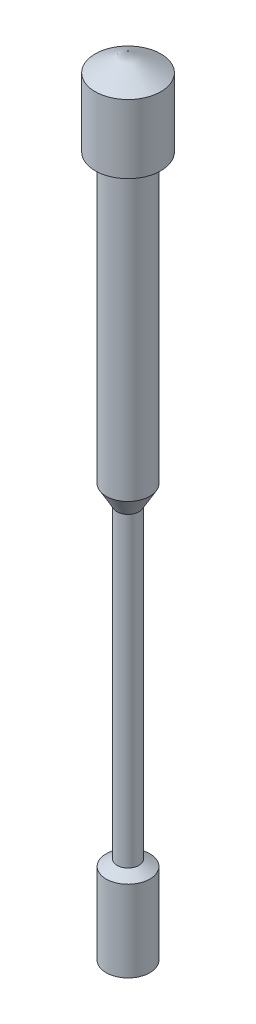
ISO-10303-21;
HEADER;
FILE_DESCRIPTION(('STEP AP214'),'2;1');
FILE_NAME('part.step','',(''),(''),'','','');
FILE_SCHEMA(('AUTOMOTIVE_DESIGN { 1 0 10303 214 1 1 1 1 }'));
ENDSEC;
DATA;
#1=APPLICATION_CONTEXT('core data for automotive mechanical design processes');
#2=APPLICATION_PROTOCOL_DEFINITION('international standard','automotive_design',2000,#1);
#3=PRODUCT_CONTEXT('',#1,'mechanical');
#4=PRODUCT('Part','Part','',(#3));
#5=PRODUCT_RELATED_PRODUCT_CATEGORY('part','',(#4));
#6=PRODUCT_DEFINITION_FORMATION('','',#4);
#7=PRODUCT_DEFINITION_CONTEXT('part definition',#1,'design');
#8=PRODUCT_DEFINITION('design','',#6,#7);
#9=PRODUCT_DEFINITION_SHAPE('','',#8);
#10=(LENGTH_UNIT() NAMED_UNIT(*) SI_UNIT(.MILLI.,.METRE.));
#11=(NAMED_UNIT(*) PLANE_ANGLE_UNIT() SI_UNIT($,.RADIAN.));
#12=(NAMED_UNIT(*) SI_UNIT($,.STERADIAN.) SOLID_ANGLE_UNIT());
#13=UNCERTAINTY_MEASURE_WITH_UNIT(LENGTH_MEASURE(1.E-05),#10,'distance_accuracy_value','');
#14=(GEOMETRIC_REPRESENTATION_CONTEXT(3) GLOBAL_UNCERTAINTY_ASSIGNED_CONTEXT((#13)) GLOBAL_UNIT_ASSIGNED_CONTEXT((#10,
#11,#12)) REPRESENTATION_CONTEXT('',''));
#15=CARTESIAN_POINT('',(0.,0.,0.));
#16=DIRECTION('',(0.,0.,1.));
#17=DIRECTION('',(1.,0.,0.));
#18=AXIS2_PLACEMENT_3D('',#15,#16,#17);
#19=CARTESIAN_POINT('',(0.,17.5669872981078,0.));
#20=DIRECTION('',(0.,-1.,0.));
#21=DIRECTION('',(0.,0.,-1.));
#22=AXIS2_PLACEMENT_3D('',#19,#20,#21);
#23=CONICAL_SURFACE('',#22,0.750000000000001,1.0471975511966);
#24=CARTESIAN_POINT('',(0.,18.,0.));
#25=VERTEX_POINT('',#24);
#26=VERTEX_LOOP('',#25);
#27=FACE_BOUND('',#26,.T.);
#28=CARTESIAN_POINT('',(0.,17.5669872981078,0.));
#29=DIRECTION('',(0.,-1.,0.));
#30=DIRECTION('',(0.,0.,-1.));
#31=AXIS2_PLACEMENT_3D('',#28,#29,#30);
#32=CIRCLE('',#31,0.750000000000001);
#33=CARTESIAN_POINT('',(0.,17.5669872981078,-0.750000000000001));
#34=VERTEX_POINT('',#33);
#35=EDGE_CURVE('E11',#34,#34,#32,.T.);
#36=ORIENTED_EDGE('',*,*,#35,.F.);
#37=EDGE_LOOP('',(#36));
#38=FACE_BOUND('',#37,.T.);
#39=ADVANCED_FACE('F33',(#27,#38),#23,.T.);
#40=CARTESIAN_POINT('',(0.,0.,0.));
#41=DIRECTION('',(0.,-1.,0.));
#42=DIRECTION('',(0.,0.,-1.));
#43=AXIS2_PLACEMENT_3D('',#40,#41,#42);
#44=CYLINDRICAL_SURFACE('',#43,0.750000000000001);
#45=ORIENTED_EDGE('',*,*,#35,.T.);
#46=EDGE_LOOP('',(#45));
#47=FACE_BOUND('',#46,.T.);
#48=CARTESIAN_POINT('',(0.,16.,0.));
#49=DIRECTION('',(0.,-1.,0.));
#50=DIRECTION('',(0.,0.,-1.));
#51=AXIS2_PLACEMENT_3D('',#48,#49,#50);
#52=CIRCLE('',#51,0.750000000000001);
#53=CARTESIAN_POINT('',(0.,16.,-0.750000000000001));
#54=VERTEX_POINT('',#53);
#55=EDGE_CURVE('E39',#54,#54,#52,.T.);
#56=ORIENTED_EDGE('',*,*,#55,.F.);
#57=EDGE_LOOP('',(#56));
#58=FACE_BOUND('',#57,.T.);
#59=ADVANCED_FACE('F44',(#47,#58),#44,.T.);
#60=CARTESIAN_POINT('',(0.750000000000001,16.,0.));
#61=DIRECTION('',(0.,-1.,0.));
#62=DIRECTION('',(0.,0.,-1.));
#63=AXIS2_PLACEMENT_3D('',#60,#61,#62);
#64=PLANE('',#63);
#65=ORIENTED_EDGE('',*,*,#55,.T.);
#66=EDGE_LOOP('',(#65));
#67=FACE_BOUND('',#66,.T.);
#68=CARTESIAN_POINT('',(0.,16.,0.));
#69=DIRECTION('',(0.,-1.,0.));
#70=DIRECTION('',(0.,0.,-1.));
#71=AXIS2_PLACEMENT_3D('',#68,#69,#70);
#72=CIRCLE('',#71,0.5);
#73=CARTESIAN_POINT('',(0.,16.,-0.5));
#74=VERTEX_POINT('',#73);
#75=EDGE_CURVE('E53',#74,#74,#72,.T.);
#76=ORIENTED_EDGE('',*,*,#75,.F.);
#77=EDGE_LOOP('',(#76));
#78=FACE_BOUND('',#77,.T.);
#79=ADVANCED_FACE('F49',(#67,#78),#64,.T.);
#80=CARTESIAN_POINT('',(0.,0.,0.));
#81=DIRECTION('',(0.,-1.,0.));
#82=DIRECTION('',(0.,0.,-1.));
#83=AXIS2_PLACEMENT_3D('',#80,#81,#82);
#84=CYLINDRICAL_SURFACE('',#83,0.5);
#85=ORIENTED_EDGE('',*,*,#75,.T.);
#86=EDGE_LOOP('',(#85));
#87=FACE_BOUND('',#86,.T.);
#88=CARTESIAN_POINT('',(0.,9.43301270189223,0.));
#89=DIRECTION('',(0.,-1.,0.));
#90=DIRECTION('',(0.,0.,-1.));
#91=AXIS2_PLACEMENT_3D('',#88,#89,#90);
#92=CIRCLE('',#91,0.500000000000001);
#93=CARTESIAN_POINT('',(0.,9.43301270189223,-0.500000000000001));
#94=VERTEX_POINT('',#93);
#95=EDGE_CURVE('E55',#94,#94,#92,.T.);
#96=ORIENTED_EDGE('',*,*,#95,.F.);
#97=EDGE_LOOP('',(#96));
#98=FACE_BOUND('',#97,.T.);
#99=ADVANCED_FACE('F95',(#87,#98),#84,.T.);
#100=CARTESIAN_POINT('',(0.,9.,0.));
#101=DIRECTION('',(0.,1.,0.));
#102=DIRECTION('',(0.,0.,1.));
#103=AXIS2_PLACEMENT_3D('',#100,#101,#102);
#104=CONICAL_SURFACE('',#103,0.25,0.523598775598295);
#105=ORIENTED_EDGE('',*,*,#95,.T.);
#106=EDGE_LOOP('',(#105));
#107=FACE_BOUND('',#106,.T.);
#108=CARTESIAN_POINT('',(0.,9.,0.));
#109=DIRECTION('',(0.,-1.,0.));
#110=DIRECTION('',(0.,0.,-1.));
#111=AXIS2_PLACEMENT_3D('',#108,#109,#110);
#112=CIRCLE('',#111,0.25);
#113=CARTESIAN_POINT('',(0.,9.,-0.25));
#114=VERTEX_POINT('',#113);
#115=EDGE_CURVE('E60',#114,#114,#112,.T.);
#116=ORIENTED_EDGE('',*,*,#115,.F.);
#117=EDGE_LOOP('',(#116));
#118=FACE_BOUND('',#117,.T.);
#119=ADVANCED_FACE('F91',(#107,#118),#104,.T.);
#120=CARTESIAN_POINT('',(0.,0.,0.));
#121=DIRECTION('',(0.,-1.,0.));
#122=DIRECTION('',(0.,0.,-1.));
#123=AXIS2_PLACEMENT_3D('',#120,#121,#122);
#124=CYLINDRICAL_SURFACE('',#123,0.25);
#125=ORIENTED_EDGE('',*,*,#115,.T.);
#126=EDGE_LOOP('',(#125));
#127=FACE_BOUND('',#126,.T.);
#128=CARTESIAN_POINT('',(0.,2.,0.));
#129=DIRECTION('',(0.,-1.,0.));
#130=DIRECTION('',(0.,0.,-1.));
#131=AXIS2_PLACEMENT_3D('',#128,#129,#130);
#132=CIRCLE('',#131,0.250000000000001);
#133=CARTESIAN_POINT('',(0.,2.,-0.250000000000001));
#134=VERTEX_POINT('',#133);
#135=EDGE_CURVE('E63',#134,#134,#132,.T.);
#136=ORIENTED_EDGE('',*,*,#135,.F.);
#137=EDGE_LOOP('',(#136));
#138=FACE_BOUND('',#137,.T.);
#139=ADVANCED_FACE('F85',(#127,#138),#124,.T.);
#140=CARTESIAN_POINT('',(0.,1.8556624327026,0.));
#141=DIRECTION('',(0.,-1.,0.));
#142=DIRECTION('',(0.,0.,-1.));
#143=AXIS2_PLACEMENT_3D('',#140,#141,#142);
#144=CONICAL_SURFACE('',#143,0.5,1.0471975511966);
#145=ORIENTED_EDGE('',*,*,#135,.T.);
#146=EDGE_LOOP('',(#145));
#147=FACE_BOUND('',#146,.T.);
#148=CARTESIAN_POINT('',(0.,1.8556624327026,0.));
#149=DIRECTION('',(0.,-1.,0.));
#150=DIRECTION('',(0.,0.,-1.));
#151=AXIS2_PLACEMENT_3D('',#148,#149,#150);
#152=CIRCLE('',#151,0.5);
#153=CARTESIAN_POINT('',(0.,1.8556624327026,-0.5));
#154=VERTEX_POINT('',#153);
#155=EDGE_CURVE('E66',#154,#154,#152,.T.);
#156=ORIENTED_EDGE('',*,*,#155,.F.);
#157=EDGE_LOOP('',(#156));
#158=FACE_BOUND('',#157,.T.);
#159=ADVANCED_FACE('F77',(#147,#158),#144,.T.);
#160=CARTESIAN_POINT('',(0.,0.,0.));
#161=DIRECTION('',(0.,-1.,0.));
#162=DIRECTION('',(0.,0.,-1.));
#163=AXIS2_PLACEMENT_3D('',#160,#161,#162);
#164=CYLINDRICAL_SURFACE('',#163,0.5);
#165=ORIENTED_EDGE('',*,*,#155,.T.);
#166=EDGE_LOOP('',(#165));
#167=FACE_BOUND('',#166,.T.);
#168=CARTESIAN_POINT('',(0.,0.,0.));
#169=DIRECTION('',(0.,-1.,0.));
#170=DIRECTION('',(0.,0.,-1.));
#171=AXIS2_PLACEMENT_3D('',#168,#169,#170);
#172=CIRCLE('',#171,0.5);
#173=CARTESIAN_POINT('',(0.,0.,-0.5));
#174=VERTEX_POINT('',#173);
#175=EDGE_CURVE('E69',#174,#174,#172,.T.);
#176=ORIENTED_EDGE('',*,*,#175,.F.);
#177=EDGE_LOOP('',(#176));
#178=FACE_BOUND('',#177,.T.);
#179=ADVANCED_FACE('F75',(#167,#178),#164,.T.);
#180=CARTESIAN_POINT('',(0.5,0.,0.));
#181=DIRECTION('',(0.,-1.,0.));
#182=DIRECTION('',(0.,0.,-1.));
#183=AXIS2_PLACEMENT_3D('',#180,#181,#182);
#184=PLANE('',#183);
#185=ORIENTED_EDGE('',*,*,#175,.T.);
#186=EDGE_LOOP('',(#185));
#187=FACE_BOUND('',#186,.T.);
#188=ADVANCED_FACE('F73',(#187),#184,.T.);
#189=CLOSED_SHELL('',(#39,#59,#79,#99,#119,#139,#159,#179,#188));
#190=MANIFOLD_SOLID_BREP('B2',#189);
#191=ADVANCED_BREP_SHAPE_REPRESENTATION('',(#18,#190),#14);
#192=SHAPE_DEFINITION_REPRESENTATION(#9,#191);
ENDSEC;
END-ISO-10303-21;
